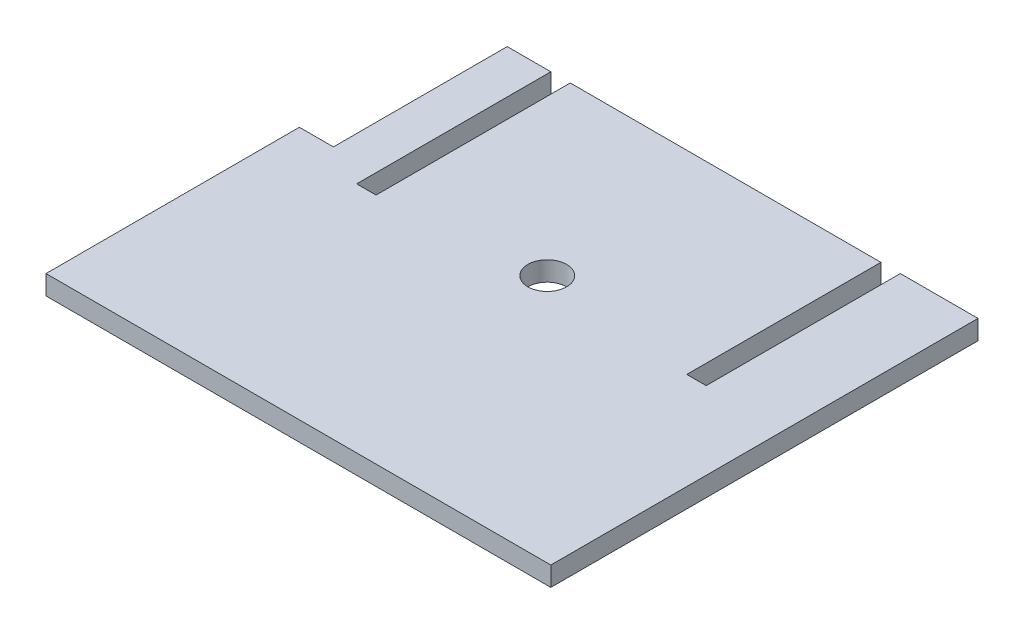
ISO-10303-21;
HEADER;
FILE_DESCRIPTION(('STEP AP214'),'2;1');
FILE_NAME('part.step','',(''),(''),'','','');
FILE_SCHEMA(('AUTOMOTIVE_DESIGN { 1 0 10303 214 1 1 1 1 }'));
ENDSEC;
DATA;
#1=APPLICATION_CONTEXT('core data for automotive mechanical design processes');
#2=APPLICATION_PROTOCOL_DEFINITION('international standard','automotive_design',2000,#1);
#3=PRODUCT_CONTEXT('',#1,'mechanical');
#4=PRODUCT('Part','Part','',(#3));
#5=PRODUCT_RELATED_PRODUCT_CATEGORY('part','',(#4));
#6=PRODUCT_DEFINITION_FORMATION('','',#4);
#7=PRODUCT_DEFINITION_CONTEXT('part definition',#1,'design');
#8=PRODUCT_DEFINITION('design','',#6,#7);
#9=PRODUCT_DEFINITION_SHAPE('','',#8);
#10=(LENGTH_UNIT() NAMED_UNIT(*) SI_UNIT(.MILLI.,.METRE.));
#11=(NAMED_UNIT(*) PLANE_ANGLE_UNIT() SI_UNIT($,.RADIAN.));
#12=(NAMED_UNIT(*) SI_UNIT($,.STERADIAN.) SOLID_ANGLE_UNIT());
#13=UNCERTAINTY_MEASURE_WITH_UNIT(LENGTH_MEASURE(1.E-05),#10,'distance_accuracy_value','');
#14=(GEOMETRIC_REPRESENTATION_CONTEXT(3) GLOBAL_UNCERTAINTY_ASSIGNED_CONTEXT((#13)) GLOBAL_UNIT_ASSIGNED_CONTEXT((#10,
#11,#12)) REPRESENTATION_CONTEXT('',''));
#15=CARTESIAN_POINT('',(0.,0.,0.));
#16=DIRECTION('',(0.,0.,1.));
#17=DIRECTION('',(1.,0.,0.));
#18=AXIS2_PLACEMENT_3D('',#15,#16,#17);
#19=CARTESIAN_POINT('',(734.900000000007,311.15,133.35));
#20=DIRECTION('',(1.,0.,0.));
#21=DIRECTION('',(0.,0.,-1.));
#22=AXIS2_PLACEMENT_3D('',#19,#20,#21);
#23=PLANE('',#22);
#24=DIRECTION('',(0.,0.,1.));
#25=VECTOR('',#24,1.);
#26=CARTESIAN_POINT('',(734.900000000007,311.15,133.35));
#27=LINE('',#26,#25);
#28=CARTESIAN_POINT('',(734.900000000007,311.15,247.022619584823));
#29=VERTEX_POINT('',#28);
#30=CARTESIAN_POINT('',(734.900000000007,311.15,412.75));
#31=VERTEX_POINT('',#30);
#32=EDGE_CURVE('E46',#29,#31,#27,.T.);
#33=ORIENTED_EDGE('',*,*,#32,.F.);
#34=DIRECTION('',(0.,1.,0.));
#35=VECTOR('',#34,1.);
#36=CARTESIAN_POINT('',(734.900000000007,298.45,247.022619584823));
#37=LINE('',#36,#35);
#38=CARTESIAN_POINT('',(734.900000000007,298.45,247.022619584823));
#39=VERTEX_POINT('',#38);
#40=EDGE_CURVE('E321',#39,#29,#37,.T.);
#41=ORIENTED_EDGE('',*,*,#40,.F.);
#42=DIRECTION('',(0.,0.,1.));
#43=VECTOR('',#42,1.);
#44=CARTESIAN_POINT('',(734.900000000007,298.45,133.35));
#45=LINE('',#44,#43);
#46=CARTESIAN_POINT('',(734.900000000007,298.45,412.75));
#47=VERTEX_POINT('',#46);
#48=EDGE_CURVE('E165',#39,#47,#45,.T.);
#49=ORIENTED_EDGE('',*,*,#48,.T.);
#50=DIRECTION('',(0.,-1.,0.));
#51=VECTOR('',#50,1.);
#52=CARTESIAN_POINT('',(734.900000000007,311.15,412.75));
#53=LINE('',#52,#51);
#54=EDGE_CURVE('E229',#31,#47,#53,.T.);
#55=ORIENTED_EDGE('',*,*,#54,.F.);
#56=EDGE_LOOP('',(#33,#41,#49,#55));
#57=FACE_BOUND('',#56,.T.);
#58=ADVANCED_FACE('F43',(#57),#23,.F.);
#59=CARTESIAN_POINT('',(1014.30000000001,311.15,412.75));
#60=DIRECTION('',(0.,0.,-1.));
#61=DIRECTION('',(-1.,0.,0.));
#62=AXIS2_PLACEMENT_3D('',#59,#60,#61);
#63=PLANE('',#62);
#64=DIRECTION('',(1.,0.,0.));
#65=VECTOR('',#64,1.);
#66=CARTESIAN_POINT('',(1014.30000000001,298.45,412.75));
#67=LINE('',#66,#65);
#68=CARTESIAN_POINT('',(1065.10000000001,298.45,412.75));
#69=VERTEX_POINT('',#68);
#70=EDGE_CURVE('E157',#47,#69,#67,.T.);
#71=ORIENTED_EDGE('',*,*,#70,.T.);
#72=DIRECTION('',(0.,-1.,0.));
#73=VECTOR('',#72,1.);
#74=CARTESIAN_POINT('',(1065.10000000001,311.15,412.75));
#75=LINE('',#74,#73);
#76=CARTESIAN_POINT('',(1065.10000000001,311.15,412.75));
#77=VERTEX_POINT('',#76);
#78=EDGE_CURVE('E233',#77,#69,#75,.T.);
#79=ORIENTED_EDGE('',*,*,#78,.F.);
#80=DIRECTION('',(1.,0.,0.));
#81=VECTOR('',#80,1.);
#82=CARTESIAN_POINT('',(734.900000000007,311.15,412.75));
#83=LINE('',#82,#81);
#84=EDGE_CURVE('E221',#31,#77,#83,.T.);
#85=ORIENTED_EDGE('',*,*,#84,.F.);
#86=ORIENTED_EDGE('',*,*,#54,.T.);
#87=EDGE_LOOP('',(#71,#79,#85,#86));
#88=FACE_BOUND('',#87,.T.);
#89=ADVANCED_FACE('F327',(#88),#63,.F.);
#90=CARTESIAN_POINT('',(1065.10000000001,311.15,133.35));
#91=DIRECTION('',(-1.,0.,0.));
#92=DIRECTION('',(0.,0.,1.));
#93=AXIS2_PLACEMENT_3D('',#90,#91,#92);
#94=PLANE('',#93);
#95=DIRECTION('',(0.,0.,-1.));
#96=VECTOR('',#95,1.);
#97=CARTESIAN_POINT('',(1065.10000000001,298.45,133.35));
#98=LINE('',#97,#96);
#99=CARTESIAN_POINT('',(1065.10000000001,298.45,133.35));
#100=VERTEX_POINT('',#99);
#101=EDGE_CURVE('E230',#69,#100,#98,.T.);
#102=ORIENTED_EDGE('',*,*,#101,.T.);
#103=DIRECTION('',(0.,-1.,0.));
#104=VECTOR('',#103,1.);
#105=CARTESIAN_POINT('',(1065.10000000001,311.15,133.35));
#106=LINE('',#105,#104);
#107=CARTESIAN_POINT('',(1065.10000000001,311.15,133.35));
#108=VERTEX_POINT('',#107);
#109=EDGE_CURVE('E239',#108,#100,#106,.T.);
#110=ORIENTED_EDGE('',*,*,#109,.F.);
#111=DIRECTION('',(0.,0.,-1.));
#112=VECTOR('',#111,1.);
#113=CARTESIAN_POINT('',(1065.10000000001,311.15,133.35));
#114=LINE('',#113,#112);
#115=EDGE_CURVE('E218',#77,#108,#114,.T.);
#116=ORIENTED_EDGE('',*,*,#115,.F.);
#117=ORIENTED_EDGE('',*,*,#78,.T.);
#118=EDGE_LOOP('',(#102,#110,#116,#117));
#119=FACE_BOUND('',#118,.T.);
#120=ADVANCED_FACE('F318',(#119),#94,.F.);
#121=CARTESIAN_POINT('',(1014.3,311.15,133.35));
#122=DIRECTION('',(0.,0.,1.));
#123=DIRECTION('',(1.,0.,0.));
#124=AXIS2_PLACEMENT_3D('',#121,#122,#123);
#125=PLANE('',#124);
#126=DIRECTION('',(-1.,0.,0.));
#127=VECTOR('',#126,1.);
#128=CARTESIAN_POINT('',(1014.3,298.45,133.35));
#129=LINE('',#128,#127);
#130=CARTESIAN_POINT('',(1014.3,298.45,133.35));
#131=VERTEX_POINT('',#130);
#132=EDGE_CURVE('E238',#100,#131,#129,.T.);
#133=ORIENTED_EDGE('',*,*,#132,.T.);
#134=DIRECTION('',(0.,-1.,0.));
#135=VECTOR('',#134,1.);
#136=CARTESIAN_POINT('',(1014.3,311.15,133.35));
#137=LINE('',#136,#135);
#138=CARTESIAN_POINT('',(1014.3,311.15,133.35));
#139=VERTEX_POINT('',#138);
#140=EDGE_CURVE('E244',#139,#131,#137,.T.);
#141=ORIENTED_EDGE('',*,*,#140,.F.);
#142=DIRECTION('',(-1.,0.,0.));
#143=VECTOR('',#142,1.);
#144=CARTESIAN_POINT('',(1014.3,311.15,133.35));
#145=LINE('',#144,#143);
#146=EDGE_CURVE('E215',#108,#139,#145,.T.);
#147=ORIENTED_EDGE('',*,*,#146,.F.);
#148=ORIENTED_EDGE('',*,*,#109,.T.);
#149=EDGE_LOOP('',(#133,#141,#147,#148));
#150=FACE_BOUND('',#149,.T.);
#151=ADVANCED_FACE('F290',(#150),#125,.F.);
#152=CARTESIAN_POINT('',(1014.3,311.15,260.35));
#153=DIRECTION('',(1.,0.,0.));
#154=DIRECTION('',(0.,0.,-1.));
#155=AXIS2_PLACEMENT_3D('',#152,#153,#154);
#156=PLANE('',#155);
#157=DIRECTION('',(0.,0.,1.));
#158=VECTOR('',#157,1.);
#159=CARTESIAN_POINT('',(1014.3,298.45,260.35));
#160=LINE('',#159,#158);
#161=CARTESIAN_POINT('',(1014.3,298.45,260.35));
#162=VERTEX_POINT('',#161);
#163=EDGE_CURVE('E243',#131,#162,#160,.T.);
#164=ORIENTED_EDGE('',*,*,#163,.T.);
#165=DIRECTION('',(0.,-1.,0.));
#166=VECTOR('',#165,1.);
#167=CARTESIAN_POINT('',(1014.3,311.15,260.35));
#168=LINE('',#167,#166);
#169=CARTESIAN_POINT('',(1014.3,311.15,260.35));
#170=VERTEX_POINT('',#169);
#171=EDGE_CURVE('E249',#170,#162,#168,.T.);
#172=ORIENTED_EDGE('',*,*,#171,.F.);
#173=DIRECTION('',(0.,0.,1.));
#174=VECTOR('',#173,1.);
#175=CARTESIAN_POINT('',(1014.3,311.15,260.35));
#176=LINE('',#175,#174);
#177=EDGE_CURVE('E212',#139,#170,#176,.T.);
#178=ORIENTED_EDGE('',*,*,#177,.F.);
#179=ORIENTED_EDGE('',*,*,#140,.T.);
#180=EDGE_LOOP('',(#164,#172,#178,#179));
#181=FACE_BOUND('',#180,.T.);
#182=ADVANCED_FACE('F298',(#181),#156,.F.);
#183=CARTESIAN_POINT('',(1001.6,311.15,260.35));
#184=DIRECTION('',(0.,0.,1.));
#185=DIRECTION('',(1.,0.,0.));
#186=AXIS2_PLACEMENT_3D('',#183,#184,#185);
#187=PLANE('',#186);
#188=DIRECTION('',(-1.,0.,0.));
#189=VECTOR('',#188,1.);
#190=CARTESIAN_POINT('',(1001.6,298.45,260.35));
#191=LINE('',#190,#189);
#192=CARTESIAN_POINT('',(1001.6,298.45,260.35));
#193=VERTEX_POINT('',#192);
#194=EDGE_CURVE('E248',#162,#193,#191,.T.);
#195=ORIENTED_EDGE('',*,*,#194,.T.);
#196=DIRECTION('',(0.,-1.,0.));
#197=VECTOR('',#196,1.);
#198=CARTESIAN_POINT('',(1001.6,311.15,260.35));
#199=LINE('',#198,#197);
#200=CARTESIAN_POINT('',(1001.6,311.15,260.35));
#201=VERTEX_POINT('',#200);
#202=EDGE_CURVE('E254',#201,#193,#199,.T.);
#203=ORIENTED_EDGE('',*,*,#202,.F.);
#204=DIRECTION('',(-1.,0.,0.));
#205=VECTOR('',#204,1.);
#206=CARTESIAN_POINT('',(1001.6,311.15,260.35));
#207=LINE('',#206,#205);
#208=EDGE_CURVE('E209',#170,#201,#207,.T.);
#209=ORIENTED_EDGE('',*,*,#208,.F.);
#210=ORIENTED_EDGE('',*,*,#171,.T.);
#211=EDGE_LOOP('',(#195,#203,#209,#210));
#212=FACE_BOUND('',#211,.T.);
#213=ADVANCED_FACE('F308',(#212),#187,.F.);
#214=CARTESIAN_POINT('',(1001.6,311.15,133.35));
#215=DIRECTION('',(-1.,0.,0.));
#216=DIRECTION('',(0.,0.,1.));
#217=AXIS2_PLACEMENT_3D('',#214,#215,#216);
#218=PLANE('',#217);
#219=DIRECTION('',(0.,0.,-1.));
#220=VECTOR('',#219,1.);
#221=CARTESIAN_POINT('',(1001.6,298.45,133.35));
#222=LINE('',#221,#220);
#223=CARTESIAN_POINT('',(1001.6,298.45,133.35));
#224=VERTEX_POINT('',#223);
#225=EDGE_CURVE('E253',#193,#224,#222,.T.);
#226=ORIENTED_EDGE('',*,*,#225,.T.);
#227=DIRECTION('',(0.,-1.,0.));
#228=VECTOR('',#227,1.);
#229=CARTESIAN_POINT('',(1001.6,311.15,133.35));
#230=LINE('',#229,#228);
#231=CARTESIAN_POINT('',(1001.6,311.15,133.35));
#232=VERTEX_POINT('',#231);
#233=EDGE_CURVE('E259',#232,#224,#230,.T.);
#234=ORIENTED_EDGE('',*,*,#233,.F.);
#235=DIRECTION('',(0.,0.,-1.));
#236=VECTOR('',#235,1.);
#237=CARTESIAN_POINT('',(1001.6,311.15,133.35));
#238=LINE('',#237,#236);
#239=EDGE_CURVE('E206',#201,#232,#238,.T.);
#240=ORIENTED_EDGE('',*,*,#239,.F.);
#241=ORIENTED_EDGE('',*,*,#202,.T.);
#242=EDGE_LOOP('',(#226,#234,#240,#241));
#243=FACE_BOUND('',#242,.T.);
#244=ADVANCED_FACE('F312',(#243),#218,.F.);
#245=CARTESIAN_POINT('',(798.400000000003,311.15,133.35));
#246=DIRECTION('',(0.,0.,1.));
#247=DIRECTION('',(1.,0.,0.));
#248=AXIS2_PLACEMENT_3D('',#245,#246,#247);
#249=PLANE('',#248);
#250=DIRECTION('',(-1.,0.,0.));
#251=VECTOR('',#250,1.);
#252=CARTESIAN_POINT('',(798.400000000003,298.45,133.35));
#253=LINE('',#252,#251);
#254=CARTESIAN_POINT('',(798.400000000003,298.45,133.35));
#255=VERTEX_POINT('',#254);
#256=EDGE_CURVE('E258',#224,#255,#253,.T.);
#257=ORIENTED_EDGE('',*,*,#256,.T.);
#258=DIRECTION('',(0.,-1.,0.));
#259=VECTOR('',#258,1.);
#260=CARTESIAN_POINT('',(798.400000000003,311.15,133.35));
#261=LINE('',#260,#259);
#262=CARTESIAN_POINT('',(798.400000000003,311.15,133.35));
#263=VERTEX_POINT('',#262);
#264=EDGE_CURVE('E264',#263,#255,#261,.T.);
#265=ORIENTED_EDGE('',*,*,#264,.F.);
#266=DIRECTION('',(-1.,0.,0.));
#267=VECTOR('',#266,1.);
#268=CARTESIAN_POINT('',(798.400000000003,311.15,133.35));
#269=LINE('',#268,#267);
#270=EDGE_CURVE('E203',#232,#263,#269,.T.);
#271=ORIENTED_EDGE('',*,*,#270,.F.);
#272=ORIENTED_EDGE('',*,*,#233,.T.);
#273=EDGE_LOOP('',(#257,#265,#271,#272));
#274=FACE_BOUND('',#273,.T.);
#275=ADVANCED_FACE('F347',(#274),#249,.F.);
#276=CARTESIAN_POINT('',(798.400000000004,311.15,260.35));
#277=DIRECTION('',(1.,0.,0.));
#278=DIRECTION('',(0.,0.,-1.));
#279=AXIS2_PLACEMENT_3D('',#276,#277,#278);
#280=PLANE('',#279);
#281=DIRECTION('',(0.,0.,1.));
#282=VECTOR('',#281,1.);
#283=CARTESIAN_POINT('',(798.400000000004,298.45,260.35));
#284=LINE('',#283,#282);
#285=CARTESIAN_POINT('',(798.400000000004,298.45,260.35));
#286=VERTEX_POINT('',#285);
#287=EDGE_CURVE('E263',#255,#286,#284,.T.);
#288=ORIENTED_EDGE('',*,*,#287,.T.);
#289=DIRECTION('',(0.,-1.,0.));
#290=VECTOR('',#289,1.);
#291=CARTESIAN_POINT('',(798.400000000004,311.15,260.35));
#292=LINE('',#291,#290);
#293=CARTESIAN_POINT('',(798.400000000004,311.15,260.35));
#294=VERTEX_POINT('',#293);
#295=EDGE_CURVE('E268',#294,#286,#292,.T.);
#296=ORIENTED_EDGE('',*,*,#295,.F.);
#297=DIRECTION('',(0.,0.,1.));
#298=VECTOR('',#297,1.);
#299=CARTESIAN_POINT('',(798.400000000004,311.15,260.35));
#300=LINE('',#299,#298);
#301=EDGE_CURVE('E201',#263,#294,#300,.T.);
#302=ORIENTED_EDGE('',*,*,#301,.F.);
#303=ORIENTED_EDGE('',*,*,#264,.T.);
#304=EDGE_LOOP('',(#288,#296,#302,#303));
#305=FACE_BOUND('',#304,.T.);
#306=ADVANCED_FACE('F350',(#305),#280,.F.);
#307=CARTESIAN_POINT('',(785.700000000007,311.15,260.35));
#308=DIRECTION('',(0.,0.,1.));
#309=DIRECTION('',(1.,0.,0.));
#310=AXIS2_PLACEMENT_3D('',#307,#308,#309);
#311=PLANE('',#310);
#312=DIRECTION('',(-1.,0.,0.));
#313=VECTOR('',#312,1.);
#314=CARTESIAN_POINT('',(785.700000000007,298.45,260.35));
#315=LINE('',#314,#313);
#316=CARTESIAN_POINT('',(785.700000000007,298.45,260.35));
#317=VERTEX_POINT('',#316);
#318=EDGE_CURVE('E267',#286,#317,#315,.T.);
#319=ORIENTED_EDGE('',*,*,#318,.T.);
#320=DIRECTION('',(0.,-1.,0.));
#321=VECTOR('',#320,1.);
#322=CARTESIAN_POINT('',(785.700000000007,311.15,260.35));
#323=LINE('',#322,#321);
#324=CARTESIAN_POINT('',(785.700000000007,311.15,260.35));
#325=VERTEX_POINT('',#324);
#326=EDGE_CURVE('E271',#325,#317,#323,.T.);
#327=ORIENTED_EDGE('',*,*,#326,.F.);
#328=DIRECTION('',(-1.,0.,0.));
#329=VECTOR('',#328,1.);
#330=CARTESIAN_POINT('',(785.700000000007,311.15,260.35));
#331=LINE('',#330,#329);
#332=EDGE_CURVE('E195',#294,#325,#331,.T.);
#333=ORIENTED_EDGE('',*,*,#332,.F.);
#334=ORIENTED_EDGE('',*,*,#295,.T.);
#335=EDGE_LOOP('',(#319,#327,#333,#334));
#336=FACE_BOUND('',#335,.T.);
#337=ADVANCED_FACE('F354',(#336),#311,.F.);
#338=CARTESIAN_POINT('',(785.700000000003,311.15,133.35));
#339=DIRECTION('',(-1.,0.,0.));
#340=DIRECTION('',(0.,0.,1.));
#341=AXIS2_PLACEMENT_3D('',#338,#339,#340);
#342=PLANE('',#341);
#343=DIRECTION('',(0.,0.,-1.));
#344=VECTOR('',#343,1.);
#345=CARTESIAN_POINT('',(785.700000000003,298.45,133.35));
#346=LINE('',#345,#344);
#347=CARTESIAN_POINT('',(785.700000000003,298.45,133.35));
#348=VERTEX_POINT('',#347);
#349=EDGE_CURVE('E117',#317,#348,#346,.T.);
#350=ORIENTED_EDGE('',*,*,#349,.T.);
#351=DIRECTION('',(0.,-1.,0.));
#352=VECTOR('',#351,1.);
#353=CARTESIAN_POINT('',(785.700000000003,311.15,133.35));
#354=LINE('',#353,#352);
#355=CARTESIAN_POINT('',(785.700000000003,311.15,133.35));
#356=VERTEX_POINT('',#355);
#357=EDGE_CURVE('E227',#356,#348,#354,.T.);
#358=ORIENTED_EDGE('',*,*,#357,.F.);
#359=DIRECTION('',(0.,0.,-1.));
#360=VECTOR('',#359,1.);
#361=CARTESIAN_POINT('',(785.700000000003,311.15,133.35));
#362=LINE('',#361,#360);
#363=EDGE_CURVE('E69',#325,#356,#362,.T.);
#364=ORIENTED_EDGE('',*,*,#363,.F.);
#365=ORIENTED_EDGE('',*,*,#326,.T.);
#366=EDGE_LOOP('',(#350,#358,#364,#365));
#367=FACE_BOUND('',#366,.T.);
#368=ADVANCED_FACE('F358',(#367),#342,.F.);
#369=CARTESIAN_POINT('',(734.900000000007,311.15,133.35));
#370=DIRECTION('',(0.,0.,1.));
#371=DIRECTION('',(1.,0.,0.));
#372=AXIS2_PLACEMENT_3D('',#369,#370,#371);
#373=PLANE('',#372);
#374=DIRECTION('',(-1.,0.,0.));
#375=VECTOR('',#374,1.);
#376=CARTESIAN_POINT('',(734.900000000007,298.45,133.35));
#377=LINE('',#376,#375);
#378=CARTESIAN_POINT('',(757.170177668499,298.45,133.35));
#379=VERTEX_POINT('',#378);
#380=EDGE_CURVE('E190',#348,#379,#377,.T.);
#381=ORIENTED_EDGE('',*,*,#380,.T.);
#382=DIRECTION('',(0.,1.,0.));
#383=VECTOR('',#382,1.);
#384=CARTESIAN_POINT('',(757.170177668499,298.45,133.35));
#385=LINE('',#384,#383);
#386=CARTESIAN_POINT('',(757.170177668499,311.15,133.35));
#387=VERTEX_POINT('',#386);
#388=EDGE_CURVE('E170',#379,#387,#385,.T.);
#389=ORIENTED_EDGE('',*,*,#388,.T.);
#390=DIRECTION('',(-1.,0.,0.));
#391=VECTOR('',#390,1.);
#392=CARTESIAN_POINT('',(734.900000000007,311.15,133.35));
#393=LINE('',#392,#391);
#394=EDGE_CURVE('E52',#356,#387,#393,.T.);
#395=ORIENTED_EDGE('',*,*,#394,.F.);
#396=ORIENTED_EDGE('',*,*,#357,.T.);
#397=EDGE_LOOP('',(#381,#389,#395,#396));
#398=FACE_BOUND('',#397,.T.);
#399=ADVANCED_FACE('F188',(#398),#373,.F.);
#400=CARTESIAN_POINT('',(0.,311.15,0.));
#401=DIRECTION('',(0.,1.,0.));
#402=DIRECTION('',(0.,0.,1.));
#403=AXIS2_PLACEMENT_3D('',#400,#401,#402);
#404=PLANE('',#403);
#405=DIRECTION('',(0.,0.,-1.));
#406=VECTOR('',#405,1.);
#407=CARTESIAN_POINT('',(757.170177668499,311.15,133.35));
#408=LINE('',#407,#406);
#409=CARTESIAN_POINT('',(757.170177668499,311.15,247.022619584823));
#410=VERTEX_POINT('',#409);
#411=EDGE_CURVE('E180',#410,#387,#408,.T.);
#412=ORIENTED_EDGE('',*,*,#411,.F.);
#413=DIRECTION('',(1.,0.,0.));
#414=VECTOR('',#413,1.);
#415=CARTESIAN_POINT('',(734.900000000007,311.15,247.022619584823));
#416=LINE('',#415,#414);
#417=EDGE_CURVE('E183',#29,#410,#416,.T.);
#418=ORIENTED_EDGE('',*,*,#417,.F.);
#419=ORIENTED_EDGE('',*,*,#32,.T.);
#420=ORIENTED_EDGE('',*,*,#84,.T.);
#421=ORIENTED_EDGE('',*,*,#115,.T.);
#422=ORIENTED_EDGE('',*,*,#146,.T.);
#423=ORIENTED_EDGE('',*,*,#177,.T.);
#424=ORIENTED_EDGE('',*,*,#208,.T.);
#425=ORIENTED_EDGE('',*,*,#239,.T.);
#426=ORIENTED_EDGE('',*,*,#270,.T.);
#427=ORIENTED_EDGE('',*,*,#301,.T.);
#428=ORIENTED_EDGE('',*,*,#332,.T.);
#429=ORIENTED_EDGE('',*,*,#363,.T.);
#430=ORIENTED_EDGE('',*,*,#394,.T.);
#431=EDGE_LOOP('',(#412,#418,#419,#420,#421,#422,#423,#424,#425,#426,#427,#428,#429,#430));
#432=FACE_BOUND('',#431,.T.);
#433=CARTESIAN_POINT('',(899.999999999995,311.15,249.999999999999));
#434=DIRECTION('',(0.,1.,0.));
#435=DIRECTION('',(0.,0.,1.));
#436=AXIS2_PLACEMENT_3D('',#433,#434,#435);
#437=CIRCLE('',#436,12.7);
#438=CARTESIAN_POINT('',(899.999999999995,311.15,262.699999999999));
#439=VERTEX_POINT('',#438);
#440=EDGE_CURVE('E224',#439,#439,#437,.F.);
#441=ORIENTED_EDGE('',*,*,#440,.T.);
#442=EDGE_LOOP('',(#441));
#443=FACE_BOUND('',#442,.T.);
#444=ADVANCED_FACE('F192',(#432,#443),#404,.T.);
#445=CARTESIAN_POINT('',(0.,298.45,0.));
#446=DIRECTION('',(0.,1.,0.));
#447=DIRECTION('',(0.,0.,1.));
#448=AXIS2_PLACEMENT_3D('',#445,#446,#447);
#449=PLANE('',#448);
#450=DIRECTION('',(1.,0.,0.));
#451=VECTOR('',#450,1.);
#452=CARTESIAN_POINT('',(734.900000000007,298.45,247.022619584823));
#453=LINE('',#452,#451);
#454=CARTESIAN_POINT('',(757.170177668499,298.45,247.022619584823));
#455=VERTEX_POINT('',#454);
#456=EDGE_CURVE('E182',#39,#455,#453,.T.);
#457=ORIENTED_EDGE('',*,*,#456,.T.);
#458=DIRECTION('',(0.,0.,-1.));
#459=VECTOR('',#458,1.);
#460=CARTESIAN_POINT('',(757.170177668499,298.45,133.35));
#461=LINE('',#460,#459);
#462=EDGE_CURVE('E60',#455,#379,#461,.T.);
#463=ORIENTED_EDGE('',*,*,#462,.T.);
#464=ORIENTED_EDGE('',*,*,#380,.F.);
#465=ORIENTED_EDGE('',*,*,#349,.F.);
#466=ORIENTED_EDGE('',*,*,#318,.F.);
#467=ORIENTED_EDGE('',*,*,#287,.F.);
#468=ORIENTED_EDGE('',*,*,#256,.F.);
#469=ORIENTED_EDGE('',*,*,#225,.F.);
#470=ORIENTED_EDGE('',*,*,#194,.F.);
#471=ORIENTED_EDGE('',*,*,#163,.F.);
#472=ORIENTED_EDGE('',*,*,#132,.F.);
#473=ORIENTED_EDGE('',*,*,#101,.F.);
#474=ORIENTED_EDGE('',*,*,#70,.F.);
#475=ORIENTED_EDGE('',*,*,#48,.F.);
#476=EDGE_LOOP('',(#457,#463,#464,#465,#466,#467,#468,#469,#470,#471,#472,#473,#474,#475));
#477=FACE_BOUND('',#476,.T.);
#478=CARTESIAN_POINT('',(899.999999999995,298.45,249.999999999999));
#479=DIRECTION('',(0.,1.,0.));
#480=DIRECTION('',(0.,0.,1.));
#481=AXIS2_PLACEMENT_3D('',#478,#479,#480);
#482=CIRCLE('',#481,12.7);
#483=CARTESIAN_POINT('',(899.999999999995,298.45,262.699999999999));
#484=VERTEX_POINT('',#483);
#485=EDGE_CURVE('E11',#484,#484,#482,.F.);
#486=ORIENTED_EDGE('',*,*,#485,.F.);
#487=EDGE_LOOP('',(#486));
#488=FACE_BOUND('',#487,.T.);
#489=ADVANCED_FACE('F302',(#477,#488),#449,.F.);
#490=CARTESIAN_POINT('',(899.999999999994,275.499546279119,249.999999999999));
#491=DIRECTION('',(0.,1.,0.));
#492=DIRECTION('',(-1.,0.,0.));
#493=AXIS2_PLACEMENT_3D('',#490,#491,#492);
#494=CYLINDRICAL_SURFACE('',#493,12.7);
#495=ORIENTED_EDGE('',*,*,#440,.F.);
#496=EDGE_LOOP('',(#495));
#497=FACE_BOUND('',#496,.T.);
#498=ORIENTED_EDGE('',*,*,#485,.T.);
#499=EDGE_LOOP('',(#498));
#500=FACE_BOUND('',#499,.T.);
#501=ADVANCED_FACE('F364',(#497,#500),#494,.F.);
#502=CARTESIAN_POINT('',(757.170177668499,298.45,133.35));
#503=DIRECTION('',(1.,0.,0.));
#504=DIRECTION('',(0.,0.,-1.));
#505=AXIS2_PLACEMENT_3D('',#502,#503,#504);
#506=PLANE('',#505);
#507=ORIENTED_EDGE('',*,*,#411,.T.);
#508=ORIENTED_EDGE('',*,*,#388,.F.);
#509=ORIENTED_EDGE('',*,*,#462,.F.);
#510=DIRECTION('',(0.,1.,0.));
#511=VECTOR('',#510,1.);
#512=CARTESIAN_POINT('',(757.170177668499,298.45,247.022619584823));
#513=LINE('',#512,#511);
#514=EDGE_CURVE('E177',#455,#410,#513,.T.);
#515=ORIENTED_EDGE('',*,*,#514,.T.);
#516=EDGE_LOOP('',(#507,#508,#509,#515));
#517=FACE_BOUND('',#516,.T.);
#518=ADVANCED_FACE('F181',(#517),#506,.F.);
#519=CARTESIAN_POINT('',(734.900000000007,298.45,247.022619584823));
#520=DIRECTION('',(0.,0.,1.));
#521=DIRECTION('',(1.,0.,0.));
#522=AXIS2_PLACEMENT_3D('',#519,#520,#521);
#523=PLANE('',#522);
#524=ORIENTED_EDGE('',*,*,#417,.T.);
#525=ORIENTED_EDGE('',*,*,#514,.F.);
#526=ORIENTED_EDGE('',*,*,#456,.F.);
#527=ORIENTED_EDGE('',*,*,#40,.T.);
#528=EDGE_LOOP('',(#524,#525,#526,#527));
#529=FACE_BOUND('',#528,.T.);
#530=ADVANCED_FACE('F325',(#529),#523,.F.);
#531=CLOSED_SHELL('',(#58,#89,#120,#151,#182,#213,#244,#275,#306,#337,#368,#399,#444,#489,#501,
#518,#530));
#532=MANIFOLD_SOLID_BREP('B2',#531);
#533=ADVANCED_BREP_SHAPE_REPRESENTATION('',(#18,#532),#14);
#534=SHAPE_DEFINITION_REPRESENTATION(#9,#533);
ENDSEC;
END-ISO-10303-21;
